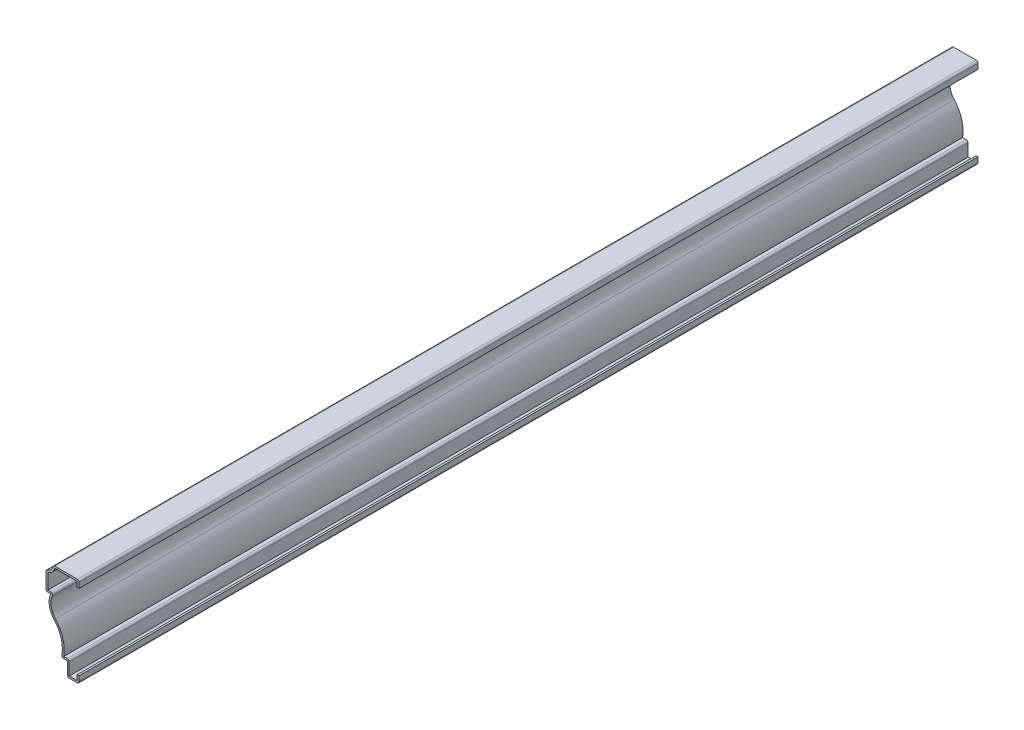
ISO-10303-21;
HEADER;
FILE_DESCRIPTION(('STEP AP214'),'2;1');
FILE_NAME('part.step','',(''),(''),'','','');
FILE_SCHEMA(('AUTOMOTIVE_DESIGN { 1 0 10303 214 1 1 1 1 }'));
ENDSEC;
DATA;
#1=APPLICATION_CONTEXT('core data for automotive mechanical design processes');
#2=APPLICATION_PROTOCOL_DEFINITION('international standard','automotive_design',2000,#1);
#3=PRODUCT_CONTEXT('',#1,'mechanical');
#4=PRODUCT('Part','Part','',(#3));
#5=PRODUCT_RELATED_PRODUCT_CATEGORY('part','',(#4));
#6=PRODUCT_DEFINITION_FORMATION('','',#4);
#7=PRODUCT_DEFINITION_CONTEXT('part definition',#1,'design');
#8=PRODUCT_DEFINITION('design','',#6,#7);
#9=PRODUCT_DEFINITION_SHAPE('','',#8);
#10=(LENGTH_UNIT() NAMED_UNIT(*) SI_UNIT(.MILLI.,.METRE.));
#11=(NAMED_UNIT(*) PLANE_ANGLE_UNIT() SI_UNIT($,.RADIAN.));
#12=(NAMED_UNIT(*) SI_UNIT($,.STERADIAN.) SOLID_ANGLE_UNIT());
#13=UNCERTAINTY_MEASURE_WITH_UNIT(LENGTH_MEASURE(1.E-05),#10,'distance_accuracy_value','');
#14=(GEOMETRIC_REPRESENTATION_CONTEXT(3) GLOBAL_UNCERTAINTY_ASSIGNED_CONTEXT((#13)) GLOBAL_UNIT_ASSIGNED_CONTEXT((#10,
#11,#12)) REPRESENTATION_CONTEXT('',''));
#15=CARTESIAN_POINT('',(0.,0.,0.));
#16=DIRECTION('',(0.,0.,1.));
#17=DIRECTION('',(1.,0.,0.));
#18=AXIS2_PLACEMENT_3D('',#15,#16,#17);
#19=CARTESIAN_POINT('',(0.,0.,-603.25));
#20=DIRECTION('',(1.,0.,0.));
#21=DIRECTION('',(0.,0.,-1.));
#22=AXIS2_PLACEMENT_3D('',#19,#20,#21);
#23=PLANE('',#22);
#24=DIRECTION('',(0.,1.,0.));
#25=VECTOR('',#24,1.);
#26=CARTESIAN_POINT('',(0.,0.,0.));
#27=LINE('',#26,#25);
#28=CARTESIAN_POINT('',(0.,1.27,0.));
#29=VERTEX_POINT('',#28);
#30=CARTESIAN_POINT('',(0.,4.7625,0.));
#31=VERTEX_POINT('',#30);
#32=EDGE_CURVE('E447',#29,#31,#27,.T.);
#33=ORIENTED_EDGE('',*,*,#32,.F.);
#34=DIRECTION('',(0.,0.,1.));
#35=VECTOR('',#34,1.);
#36=CARTESIAN_POINT('',(0.,1.27,-603.25));
#37=LINE('',#36,#35);
#38=CARTESIAN_POINT('',(0.,1.27,-603.25));
#39=VERTEX_POINT('',#38);
#40=EDGE_CURVE('E259',#29,#39,#37,.F.);
#41=ORIENTED_EDGE('',*,*,#40,.T.);
#42=DIRECTION('',(0.,1.,0.));
#43=VECTOR('',#42,1.);
#44=CARTESIAN_POINT('',(0.,0.,-603.25));
#45=LINE('',#44,#43);
#46=CARTESIAN_POINT('',(0.,4.7625,-603.25));
#47=VERTEX_POINT('',#46);
#48=EDGE_CURVE('E252',#39,#47,#45,.T.);
#49=ORIENTED_EDGE('',*,*,#48,.T.);
#50=DIRECTION('',(0.,0.,1.));
#51=VECTOR('',#50,1.);
#52=CARTESIAN_POINT('',(0.,4.7625,-603.25));
#53=LINE('',#52,#51);
#54=EDGE_CURVE('E256',#47,#31,#53,.T.);
#55=ORIENTED_EDGE('',*,*,#54,.T.);
#56=EDGE_LOOP('',(#33,#41,#49,#55));
#57=FACE_BOUND('',#56,.T.);
#58=ADVANCED_FACE('F35',(#57),#23,.T.);
#59=CARTESIAN_POINT('',(-7.9375,0.,-603.25));
#60=DIRECTION('',(0.,-1.,0.));
#61=DIRECTION('',(0.,0.,-1.));
#62=AXIS2_PLACEMENT_3D('',#59,#60,#61);
#63=PLANE('',#62);
#64=DIRECTION('',(1.,0.,0.));
#65=VECTOR('',#64,1.);
#66=CARTESIAN_POINT('',(-7.9375,0.,-603.25));
#67=LINE('',#66,#65);
#68=CARTESIAN_POINT('',(-6.6675,0.,-603.25));
#69=VERTEX_POINT('',#68);
#70=CARTESIAN_POINT('',(-1.27,0.,-603.25));
#71=VERTEX_POINT('',#70);
#72=EDGE_CURVE('E276',#69,#71,#67,.T.);
#73=ORIENTED_EDGE('',*,*,#72,.T.);
#74=DIRECTION('',(0.,0.,1.));
#75=VECTOR('',#74,1.);
#76=CARTESIAN_POINT('',(-1.27,0.,-603.25));
#77=LINE('',#76,#75);
#78=CARTESIAN_POINT('',(-1.27,0.,0.));
#79=VERTEX_POINT('',#78);
#80=EDGE_CURVE('E287',#71,#79,#77,.T.);
#81=ORIENTED_EDGE('',*,*,#80,.T.);
#82=DIRECTION('',(1.,0.,0.));
#83=VECTOR('',#82,1.);
#84=CARTESIAN_POINT('',(-7.9375,0.,0.));
#85=LINE('',#84,#83);
#86=CARTESIAN_POINT('',(-6.6675,0.,0.));
#87=VERTEX_POINT('',#86);
#88=EDGE_CURVE('E262',#87,#79,#85,.T.);
#89=ORIENTED_EDGE('',*,*,#88,.F.);
#90=DIRECTION('',(0.,0.,1.));
#91=VECTOR('',#90,1.);
#92=CARTESIAN_POINT('',(-6.6675,0.,-603.25));
#93=LINE('',#92,#91);
#94=EDGE_CURVE('E285',#87,#69,#93,.F.);
#95=ORIENTED_EDGE('',*,*,#94,.T.);
#96=EDGE_LOOP('',(#73,#81,#89,#95));
#97=FACE_BOUND('',#96,.T.);
#98=ADVANCED_FACE('F531',(#97),#63,.T.);
#99=CARTESIAN_POINT('',(-7.9375,9.525,-603.25));
#100=DIRECTION('',(-1.,0.,0.));
#101=DIRECTION('',(0.,-1.,0.));
#102=AXIS2_PLACEMENT_3D('',#99,#100,#101);
#103=PLANE('',#102);
#104=DIRECTION('',(0.,-1.,0.));
#105=VECTOR('',#104,1.);
#106=CARTESIAN_POINT('',(-7.9375,9.525,-603.25));
#107=LINE('',#106,#105);
#108=CARTESIAN_POINT('',(-7.9375,9.525,-603.25));
#109=VERTEX_POINT('',#108);
#110=CARTESIAN_POINT('',(-7.9375,1.27,-603.25));
#111=VERTEX_POINT('',#110);
#112=EDGE_CURVE('E281',#109,#111,#107,.T.);
#113=ORIENTED_EDGE('',*,*,#112,.T.);
#114=DIRECTION('',(0.,0.,1.));
#115=VECTOR('',#114,1.);
#116=CARTESIAN_POINT('',(-7.9375,1.27,-603.25));
#117=LINE('',#116,#115);
#118=CARTESIAN_POINT('',(-7.9375,1.27,0.));
#119=VERTEX_POINT('',#118);
#120=EDGE_CURVE('E327',#111,#119,#117,.T.);
#121=ORIENTED_EDGE('',*,*,#120,.T.);
#122=DIRECTION('',(0.,-1.,0.));
#123=VECTOR('',#122,1.);
#124=CARTESIAN_POINT('',(-7.9375,9.525,0.));
#125=LINE('',#124,#123);
#126=CARTESIAN_POINT('',(-7.9375,9.525,0.));
#127=VERTEX_POINT('',#126);
#128=EDGE_CURVE('E397',#127,#119,#125,.T.);
#129=ORIENTED_EDGE('',*,*,#128,.F.);
#130=DIRECTION('',(0.,0.,1.));
#131=VECTOR('',#130,1.);
#132=CARTESIAN_POINT('',(-7.9375,9.525,-603.25));
#133=LINE('',#132,#131);
#134=EDGE_CURVE('E288',#109,#127,#133,.T.);
#135=ORIENTED_EDGE('',*,*,#134,.F.);
#136=EDGE_LOOP('',(#113,#121,#129,#135));
#137=FACE_BOUND('',#136,.T.);
#138=ADVANCED_FACE('F541',(#137),#103,.T.);
#139=CARTESIAN_POINT('',(-11.90625,9.525,-603.25));
#140=DIRECTION('',(0.,-1.,0.));
#141=DIRECTION('',(0.,0.,-1.));
#142=AXIS2_PLACEMENT_3D('',#139,#140,#141);
#143=PLANE('',#142);
#144=DIRECTION('',(1.,0.,0.));
#145=VECTOR('',#144,1.);
#146=CARTESIAN_POINT('',(-11.90625,9.525,0.));
#147=LINE('',#146,#145);
#148=CARTESIAN_POINT('',(-10.3416076078881,9.525,0.));
#149=VERTEX_POINT('',#148);
#150=EDGE_CURVE('E395',#149,#127,#147,.T.);
#151=ORIENTED_EDGE('',*,*,#150,.F.);
#152=DIRECTION('',(0.,0.,1.));
#153=VECTOR('',#152,1.);
#154=CARTESIAN_POINT('',(-10.3416076078881,9.525,-603.25));
#155=LINE('',#154,#153);
#156=CARTESIAN_POINT('',(-10.3416076078881,9.525,-603.25));
#157=VERTEX_POINT('',#156);
#158=EDGE_CURVE('E337',#149,#157,#155,.F.);
#159=ORIENTED_EDGE('',*,*,#158,.T.);
#160=DIRECTION('',(1.,0.,0.));
#161=VECTOR('',#160,1.);
#162=CARTESIAN_POINT('',(-11.90625,9.525,-603.25));
#163=LINE('',#162,#161);
#164=EDGE_CURVE('E522',#157,#109,#163,.T.);
#165=ORIENTED_EDGE('',*,*,#164,.T.);
#166=ORIENTED_EDGE('',*,*,#134,.T.);
#167=EDGE_LOOP('',(#151,#159,#165,#166));
#168=FACE_BOUND('',#167,.T.);
#169=ADVANCED_FACE('F545',(#168),#143,.T.);
#170=CARTESIAN_POINT('',(-32.7071953191886,14.684375,-603.25));
#171=DIRECTION('',(0.,0.,1.));
#172=DIRECTION('',(1.,0.,0.));
#173=AXIS2_PLACEMENT_3D('',#170,#171,#172);
#174=CYLINDRICAL_SURFACE('',#173,21.43125);
#175=CARTESIAN_POINT('',(-32.7071953191886,14.684375,-603.25));
#176=DIRECTION('',(0.,0.,-1.));
#177=DIRECTION('',(-1.,0.,0.));
#178=AXIS2_PLACEMENT_3D('',#175,#176,#177);
#179=CIRCLE('',#178,21.43125);
#180=CARTESIAN_POINT('',(-16.8450266431102,29.095831604179,-603.25));
#181=VERTEX_POINT('',#180);
#182=CARTESIAN_POINT('',(-11.5928292980308,11.0125874125874,-603.25));
#183=VERTEX_POINT('',#182);
#184=EDGE_CURVE('E519',#181,#183,#179,.T.);
#185=ORIENTED_EDGE('',*,*,#184,.T.);
#186=DIRECTION('',(0.,0.,1.));
#187=VECTOR('',#186,1.);
#188=CARTESIAN_POINT('',(-11.5928292980308,11.0125874125874,-603.25));
#189=LINE('',#188,#187);
#190=CARTESIAN_POINT('',(-11.5928292980308,11.0125874125874,0.));
#191=VERTEX_POINT('',#190);
#192=EDGE_CURVE('E334',#183,#191,#189,.T.);
#193=ORIENTED_EDGE('',*,*,#192,.T.);
#194=CARTESIAN_POINT('',(-32.7071953191886,14.684375,0.));
#195=DIRECTION('',(0.,0.,-1.));
#196=DIRECTION('',(-1.,0.,0.));
#197=AXIS2_PLACEMENT_3D('',#194,#195,#196);
#198=CIRCLE('',#197,21.43125);
#199=CARTESIAN_POINT('',(-16.8450266431102,29.095831604179,0.));
#200=VERTEX_POINT('',#199);
#201=EDGE_CURVE('E392',#200,#191,#198,.T.);
#202=ORIENTED_EDGE('',*,*,#201,.F.);
#203=DIRECTION('',(0.,0.,1.));
#204=VECTOR('',#203,1.);
#205=CARTESIAN_POINT('',(-16.8450266431102,29.095831604179,-603.25));
#206=LINE('',#205,#204);
#207=EDGE_CURVE('E403',#181,#200,#206,.T.);
#208=ORIENTED_EDGE('',*,*,#207,.F.);
#209=EDGE_LOOP('',(#185,#193,#202,#208));
#210=FACE_BOUND('',#209,.T.);
#211=ADVANCED_FACE('F554',(#210),#174,.F.);
#212=CARTESIAN_POINT('',(-7.44522298321182,37.6359540362851,-603.25));
#213=DIRECTION('',(0.,0.,1.));
#214=DIRECTION('',(1.,0.,0.));
#215=AXIS2_PLACEMENT_3D('',#212,#213,#214);
#216=CYLINDRICAL_SURFACE('',#215,12.7);
#217=CARTESIAN_POINT('',(-7.44522298321182,37.6359540362851,0.));
#218=DIRECTION('',(0.,0.,1.));
#219=DIRECTION('',(1.,0.,0.));
#220=AXIS2_PLACEMENT_3D('',#217,#218,#219);
#221=CIRCLE('',#220,12.7);
#222=CARTESIAN_POINT('',(-19.05,42.7953290362851,0.));
#223=VERTEX_POINT('',#222);
#224=EDGE_CURVE('E389',#223,#200,#221,.T.);
#225=ORIENTED_EDGE('',*,*,#224,.F.);
#226=DIRECTION('',(0.,0.,1.));
#227=VECTOR('',#226,1.);
#228=CARTESIAN_POINT('',(-19.05,42.7953290362851,-603.25));
#229=LINE('',#228,#227);
#230=CARTESIAN_POINT('',(-19.05,42.7953290362851,-603.25));
#231=VERTEX_POINT('',#230);
#232=EDGE_CURVE('E405',#231,#223,#229,.T.);
#233=ORIENTED_EDGE('',*,*,#232,.F.);
#234=CARTESIAN_POINT('',(-7.44522298321182,37.6359540362851,-603.25));
#235=DIRECTION('',(0.,0.,1.));
#236=DIRECTION('',(1.,0.,0.));
#237=AXIS2_PLACEMENT_3D('',#234,#235,#236);
#238=CIRCLE('',#237,12.7);
#239=EDGE_CURVE('E516',#231,#181,#238,.T.);
#240=ORIENTED_EDGE('',*,*,#239,.T.);
#241=ORIENTED_EDGE('',*,*,#207,.T.);
#242=EDGE_LOOP('',(#225,#233,#240,#241));
#243=FACE_BOUND('',#242,.T.);
#244=ADVANCED_FACE('F559',(#243),#216,.T.);
#245=CARTESIAN_POINT('',(-22.225,42.7953290362851,-603.25));
#246=DIRECTION('',(0.,-1.,0.));
#247=DIRECTION('',(1.,0.,0.));
#248=AXIS2_PLACEMENT_3D('',#245,#246,#247);
#249=PLANE('',#248);
#250=DIRECTION('',(1.,0.,0.));
#251=VECTOR('',#250,1.);
#252=CARTESIAN_POINT('',(-22.225,42.7953290362851,0.));
#253=LINE('',#252,#251);
#254=CARTESIAN_POINT('',(-20.955,42.7953290362851,0.));
#255=VERTEX_POINT('',#254);
#256=EDGE_CURVE('E387',#255,#223,#253,.T.);
#257=ORIENTED_EDGE('',*,*,#256,.F.);
#258=DIRECTION('',(0.,0.,1.));
#259=VECTOR('',#258,1.);
#260=CARTESIAN_POINT('',(-20.955,42.7953290362851,-603.25));
#261=LINE('',#260,#259);
#262=CARTESIAN_POINT('',(-20.955,42.7953290362851,-603.25));
#263=VERTEX_POINT('',#262);
#264=EDGE_CURVE('E349',#255,#263,#261,.F.);
#265=ORIENTED_EDGE('',*,*,#264,.T.);
#266=DIRECTION('',(1.,0.,0.));
#267=VECTOR('',#266,1.);
#268=CARTESIAN_POINT('',(-22.225,42.7953290362851,-603.25));
#269=LINE('',#268,#267);
#270=EDGE_CURVE('E514',#263,#231,#269,.T.);
#271=ORIENTED_EDGE('',*,*,#270,.T.);
#272=ORIENTED_EDGE('',*,*,#232,.T.);
#273=EDGE_LOOP('',(#257,#265,#271,#272));
#274=FACE_BOUND('',#273,.T.);
#275=ADVANCED_FACE('F807',(#274),#249,.T.);
#276=CARTESIAN_POINT('',(-22.225,55.5625,-603.25));
#277=DIRECTION('',(-1.,0.,0.));
#278=DIRECTION('',(0.,-1.,0.));
#279=AXIS2_PLACEMENT_3D('',#276,#277,#278);
#280=PLANE('',#279);
#281=DIRECTION('',(0.,-1.,0.));
#282=VECTOR('',#281,1.);
#283=CARTESIAN_POINT('',(-22.225,55.5625,-603.25));
#284=LINE('',#283,#282);
#285=CARTESIAN_POINT('',(-22.225,54.4276992403304,-603.25));
#286=VERTEX_POINT('',#285);
#287=CARTESIAN_POINT('',(-22.225,44.0653290362851,-603.25));
#288=VERTEX_POINT('',#287);
#289=EDGE_CURVE('E511',#286,#288,#284,.T.);
#290=ORIENTED_EDGE('',*,*,#289,.T.);
#291=DIRECTION('',(0.,0.,1.));
#292=VECTOR('',#291,1.);
#293=CARTESIAN_POINT('',(-22.225,44.0653290362851,-603.25));
#294=LINE('',#293,#292);
#295=CARTESIAN_POINT('',(-22.225,44.0653290362851,0.));
#296=VERTEX_POINT('',#295);
#297=EDGE_CURVE('E346',#288,#296,#294,.T.);
#298=ORIENTED_EDGE('',*,*,#297,.T.);
#299=DIRECTION('',(0.,-1.,0.));
#300=VECTOR('',#299,1.);
#301=CARTESIAN_POINT('',(-22.225,55.5625,0.));
#302=LINE('',#301,#300);
#303=CARTESIAN_POINT('',(-22.225,54.4276992403304,0.));
#304=VERTEX_POINT('',#303);
#305=EDGE_CURVE('E379',#304,#296,#302,.T.);
#306=ORIENTED_EDGE('',*,*,#305,.F.);
#307=DIRECTION('',(0.,0.,1.));
#308=VECTOR('',#307,1.);
#309=CARTESIAN_POINT('',(-22.225,54.4276992403304,-603.25));
#310=LINE('',#309,#308);
#311=EDGE_CURVE('E344',#304,#286,#310,.F.);
#312=ORIENTED_EDGE('',*,*,#311,.T.);
#313=EDGE_LOOP('',(#290,#298,#306,#312));
#314=FACE_BOUND('',#313,.T.);
#315=ADVANCED_FACE('F571',(#314),#280,.T.);
#316=CARTESIAN_POINT('',(-22.225,60.325,-603.25));
#317=DIRECTION('',(0.,0.,1.));
#318=DIRECTION('',(1.,0.,0.));
#319=AXIS2_PLACEMENT_3D('',#316,#317,#318);
#320=CYLINDRICAL_SURFACE('',#319,4.7625);
#321=CARTESIAN_POINT('',(-22.225,60.325,-603.25));
#322=DIRECTION('',(0.,0.,-1.));
#323=DIRECTION('',(-1.,0.,0.));
#324=AXIS2_PLACEMENT_3D('',#321,#322,#323);
#325=CIRCLE('',#324,4.7625);
#326=CARTESIAN_POINT('',(-17.5692362423661,59.3223684210526,-603.25));
#327=VERTEX_POINT('',#326);
#328=CARTESIAN_POINT('',(-21.2223684210526,55.6692362423661,-603.25));
#329=VERTEX_POINT('',#328);
#330=EDGE_CURVE('E508',#327,#329,#325,.T.);
#331=ORIENTED_EDGE('',*,*,#330,.T.);
#332=DIRECTION('',(0.,0.,1.));
#333=VECTOR('',#332,1.);
#334=CARTESIAN_POINT('',(-21.2223684210526,55.6692362423661,-603.25));
#335=LINE('',#334,#333);
#336=CARTESIAN_POINT('',(-21.2223684210526,55.6692362423661,0.));
#337=VERTEX_POINT('',#336);
#338=EDGE_CURVE('E353',#329,#337,#335,.T.);
#339=ORIENTED_EDGE('',*,*,#338,.T.);
#340=CARTESIAN_POINT('',(-22.225,60.325,0.));
#341=DIRECTION('',(0.,0.,-1.));
#342=DIRECTION('',(-1.,0.,0.));
#343=AXIS2_PLACEMENT_3D('',#340,#341,#342);
#344=CIRCLE('',#343,4.7625);
#345=CARTESIAN_POINT('',(-17.5692362423661,59.3223684210526,0.));
#346=VERTEX_POINT('',#345);
#347=EDGE_CURVE('E376',#346,#337,#344,.T.);
#348=ORIENTED_EDGE('',*,*,#347,.F.);
#349=DIRECTION('',(0.,0.,1.));
#350=VECTOR('',#349,1.);
#351=CARTESIAN_POINT('',(-17.5692362423661,59.3223684210526,-603.25));
#352=LINE('',#351,#350);
#353=EDGE_CURVE('E351',#346,#327,#352,.F.);
#354=ORIENTED_EDGE('',*,*,#353,.T.);
#355=EDGE_LOOP('',(#331,#339,#348,#354));
#356=FACE_BOUND('',#355,.T.);
#357=ADVANCED_FACE('F578',(#356),#320,.F.);
#358=CARTESIAN_POINT('',(0.,60.325,-603.25));
#359=DIRECTION('',(0.,1.,0.));
#360=DIRECTION('',(0.,0.,1.));
#361=AXIS2_PLACEMENT_3D('',#358,#359,#360);
#362=PLANE('',#361);
#363=DIRECTION('',(-1.,0.,0.));
#364=VECTOR('',#363,1.);
#365=CARTESIAN_POINT('',(0.,60.325,-603.25));
#366=LINE('',#365,#364);
#367=CARTESIAN_POINT('',(-1.27,60.325,-603.25));
#368=VERTEX_POINT('',#367);
#369=CARTESIAN_POINT('',(-16.3276992403304,60.325,-603.25));
#370=VERTEX_POINT('',#369);
#371=EDGE_CURVE('E367',#368,#370,#366,.T.);
#372=ORIENTED_EDGE('',*,*,#371,.T.);
#373=DIRECTION('',(0.,0.,1.));
#374=VECTOR('',#373,1.);
#375=CARTESIAN_POINT('',(-16.3276992403304,60.325,-603.25));
#376=LINE('',#375,#374);
#377=CARTESIAN_POINT('',(-16.3276992403304,60.325,0.));
#378=VERTEX_POINT('',#377);
#379=EDGE_CURVE('E43',#370,#378,#376,.T.);
#380=ORIENTED_EDGE('',*,*,#379,.T.);
#381=DIRECTION('',(-1.,0.,0.));
#382=VECTOR('',#381,1.);
#383=CARTESIAN_POINT('',(0.,60.325,0.));
#384=LINE('',#383,#382);
#385=CARTESIAN_POINT('',(-1.27,60.325,0.));
#386=VERTEX_POINT('',#385);
#387=EDGE_CURVE('E364',#386,#378,#384,.T.);
#388=ORIENTED_EDGE('',*,*,#387,.F.);
#389=DIRECTION('',(0.,0.,1.));
#390=VECTOR('',#389,1.);
#391=CARTESIAN_POINT('',(-1.27,60.325,-603.25));
#392=LINE('',#391,#390);
#393=EDGE_CURVE('E356',#386,#368,#392,.F.);
#394=ORIENTED_EDGE('',*,*,#393,.T.);
#395=EDGE_LOOP('',(#372,#380,#388,#394));
#396=FACE_BOUND('',#395,.T.);
#397=ADVANCED_FACE('F363',(#396),#362,.T.);
#398=CARTESIAN_POINT('',(0.,55.5625,-603.25));
#399=DIRECTION('',(1.,0.,0.));
#400=DIRECTION('',(0.,0.,-1.));
#401=AXIS2_PLACEMENT_3D('',#398,#399,#400);
#402=PLANE('',#401);
#403=DIRECTION('',(0.,1.,0.));
#404=VECTOR('',#403,1.);
#405=CARTESIAN_POINT('',(0.,55.5625,-603.25));
#406=LINE('',#405,#404);
#407=CARTESIAN_POINT('',(0.,55.5625,-603.25));
#408=VERTEX_POINT('',#407);
#409=CARTESIAN_POINT('',(0.,59.055,-603.25));
#410=VERTEX_POINT('',#409);
#411=EDGE_CURVE('E504',#408,#410,#406,.T.);
#412=ORIENTED_EDGE('',*,*,#411,.T.);
#413=DIRECTION('',(0.,0.,1.));
#414=VECTOR('',#413,1.);
#415=CARTESIAN_POINT('',(0.,59.055,-603.25));
#416=LINE('',#415,#414);
#417=CARTESIAN_POINT('',(0.,59.055,0.));
#418=VERTEX_POINT('',#417);
#419=EDGE_CURVE('E11',#410,#418,#416,.T.);
#420=ORIENTED_EDGE('',*,*,#419,.T.);
#421=DIRECTION('',(0.,1.,0.));
#422=VECTOR('',#421,1.);
#423=CARTESIAN_POINT('',(0.,55.5625,0.));
#424=LINE('',#423,#422);
#425=CARTESIAN_POINT('',(0.,55.5625,0.));
#426=VERTEX_POINT('',#425);
#427=EDGE_CURVE('E377',#426,#418,#424,.T.);
#428=ORIENTED_EDGE('',*,*,#427,.F.);
#429=DIRECTION('',(0.,0.,1.));
#430=VECTOR('',#429,1.);
#431=CARTESIAN_POINT('',(0.,55.5625,-603.25));
#432=LINE('',#431,#430);
#433=EDGE_CURVE('E408',#408,#426,#432,.T.);
#434=ORIENTED_EDGE('',*,*,#433,.F.);
#435=EDGE_LOOP('',(#412,#420,#428,#434));
#436=FACE_BOUND('',#435,.T.);
#437=ADVANCED_FACE('F777',(#436),#402,.T.);
#438=CARTESIAN_POINT('',(0.,55.5625,-603.25));
#439=DIRECTION('',(0.,1.,0.));
#440=DIRECTION('',(0.,0.,1.));
#441=AXIS2_PLACEMENT_3D('',#438,#439,#440);
#442=PLANE('',#441);
#443=DIRECTION('',(-1.,0.,0.));
#444=VECTOR('',#443,1.);
#445=CARTESIAN_POINT('',(0.,55.5625,0.));
#446=LINE('',#445,#444);
#447=CARTESIAN_POINT('',(-1.27,55.5625,0.));
#448=VERTEX_POINT('',#447);
#449=EDGE_CURVE('E381',#426,#448,#446,.T.);
#450=ORIENTED_EDGE('',*,*,#449,.T.);
#451=DIRECTION('',(0.,0.,1.));
#452=VECTOR('',#451,1.);
#453=CARTESIAN_POINT('',(-1.27,55.5625,-603.25));
#454=LINE('',#453,#452);
#455=CARTESIAN_POINT('',(-1.27,55.5625,-603.25));
#456=VERTEX_POINT('',#455);
#457=EDGE_CURVE('E410',#456,#448,#454,.T.);
#458=ORIENTED_EDGE('',*,*,#457,.F.);
#459=DIRECTION('',(-1.,0.,0.));
#460=VECTOR('',#459,1.);
#461=CARTESIAN_POINT('',(0.,55.5625,-603.25));
#462=LINE('',#461,#460);
#463=EDGE_CURVE('E502',#408,#456,#462,.T.);
#464=ORIENTED_EDGE('',*,*,#463,.F.);
#465=ORIENTED_EDGE('',*,*,#433,.T.);
#466=EDGE_LOOP('',(#450,#458,#464,#465));
#467=FACE_BOUND('',#466,.T.);
#468=ADVANCED_FACE('F471',(#467),#442,.F.);
#469=CARTESIAN_POINT('',(-1.27,55.5625,-603.25));
#470=DIRECTION('',(1.,0.,0.));
#471=DIRECTION('',(0.,0.,-1.));
#472=AXIS2_PLACEMENT_3D('',#469,#470,#471);
#473=PLANE('',#472);
#474=DIRECTION('',(0.,1.,0.));
#475=VECTOR('',#474,1.);
#476=CARTESIAN_POINT('',(-1.27,55.5625,0.));
#477=LINE('',#476,#475);
#478=CARTESIAN_POINT('',(-1.27,59.055,0.));
#479=VERTEX_POINT('',#478);
#480=EDGE_CURVE('E467',#448,#479,#477,.T.);
#481=ORIENTED_EDGE('',*,*,#480,.T.);
#482=DIRECTION('',(0.,0.,1.));
#483=VECTOR('',#482,1.);
#484=CARTESIAN_POINT('',(-1.27,59.055,-603.25));
#485=LINE('',#484,#483);
#486=CARTESIAN_POINT('',(-1.27,59.055,-603.25));
#487=VERTEX_POINT('',#486);
#488=EDGE_CURVE('E413',#487,#479,#485,.T.);
#489=ORIENTED_EDGE('',*,*,#488,.F.);
#490=DIRECTION('',(0.,1.,0.));
#491=VECTOR('',#490,1.);
#492=CARTESIAN_POINT('',(-1.27,55.5625,-603.25));
#493=LINE('',#492,#491);
#494=EDGE_CURVE('E479',#456,#487,#493,.T.);
#495=ORIENTED_EDGE('',*,*,#494,.F.);
#496=ORIENTED_EDGE('',*,*,#457,.T.);
#497=EDGE_LOOP('',(#481,#489,#495,#496));
#498=FACE_BOUND('',#497,.T.);
#499=ADVANCED_FACE('F477',(#498),#473,.F.);
#500=CARTESIAN_POINT('',(0.,59.055,-603.25));
#501=DIRECTION('',(0.,1.,0.));
#502=DIRECTION('',(0.,0.,1.));
#503=AXIS2_PLACEMENT_3D('',#500,#501,#502);
#504=PLANE('',#503);
#505=DIRECTION('',(1.,0.,0.));
#506=VECTOR('',#505,1.);
#507=CARTESIAN_POINT('',(0.,59.055,0.));
#508=LINE('',#507,#506);
#509=CARTESIAN_POINT('',(-16.3276992403304,59.055,0.));
#510=VERTEX_POINT('',#509);
#511=EDGE_CURVE('E465',#479,#510,#508,.F.);
#512=ORIENTED_EDGE('',*,*,#511,.T.);
#513=DIRECTION('',(0.,0.,1.));
#514=VECTOR('',#513,1.);
#515=CARTESIAN_POINT('',(-16.3276992403304,59.055,-603.25));
#516=LINE('',#515,#514);
#517=CARTESIAN_POINT('',(-16.3276992403304,59.055,-603.25));
#518=VERTEX_POINT('',#517);
#519=EDGE_CURVE('E416',#518,#510,#516,.T.);
#520=ORIENTED_EDGE('',*,*,#519,.F.);
#521=DIRECTION('',(1.,0.,0.));
#522=VECTOR('',#521,1.);
#523=CARTESIAN_POINT('',(0.,59.055,-603.25));
#524=LINE('',#523,#522);
#525=EDGE_CURVE('E493',#487,#518,#524,.F.);
#526=ORIENTED_EDGE('',*,*,#525,.F.);
#527=ORIENTED_EDGE('',*,*,#488,.T.);
#528=EDGE_LOOP('',(#512,#520,#526,#527));
#529=FACE_BOUND('',#528,.T.);
#530=ADVANCED_FACE('F485',(#529),#504,.F.);
#531=CARTESIAN_POINT('',(-22.225,60.325,-603.25));
#532=DIRECTION('',(0.,0.,1.));
#533=DIRECTION('',(1.,0.,0.));
#534=AXIS2_PLACEMENT_3D('',#531,#532,#533);
#535=CYLINDRICAL_SURFACE('',#534,6.0325);
#536=CARTESIAN_POINT('',(-22.225,60.325,0.));
#537=DIRECTION('',(0.,0.,1.));
#538=DIRECTION('',(1.,0.,0.));
#539=AXIS2_PLACEMENT_3D('',#536,#537,#538);
#540=CIRCLE('',#539,6.0325);
#541=CARTESIAN_POINT('',(-20.955,54.4276992403304,0.));
#542=VERTEX_POINT('',#541);
#543=EDGE_CURVE('E463',#510,#542,#540,.F.);
#544=ORIENTED_EDGE('',*,*,#543,.T.);
#545=DIRECTION('',(0.,0.,1.));
#546=VECTOR('',#545,1.);
#547=CARTESIAN_POINT('',(-20.955,54.4276992403304,-603.25));
#548=LINE('',#547,#546);
#549=CARTESIAN_POINT('',(-20.955,54.4276992403304,-603.25));
#550=VERTEX_POINT('',#549);
#551=EDGE_CURVE('E419',#550,#542,#548,.T.);
#552=ORIENTED_EDGE('',*,*,#551,.F.);
#553=CARTESIAN_POINT('',(-22.225,60.325,-603.25));
#554=DIRECTION('',(0.,0.,1.));
#555=DIRECTION('',(1.,0.,0.));
#556=AXIS2_PLACEMENT_3D('',#553,#554,#555);
#557=CIRCLE('',#556,6.0325);
#558=EDGE_CURVE('E491',#518,#550,#557,.F.);
#559=ORIENTED_EDGE('',*,*,#558,.F.);
#560=ORIENTED_EDGE('',*,*,#519,.T.);
#561=EDGE_LOOP('',(#544,#552,#559,#560));
#562=FACE_BOUND('',#561,.T.);
#563=ADVANCED_FACE('F489',(#562),#535,.T.);
#564=CARTESIAN_POINT('',(-20.955,55.5625,-603.25));
#565=DIRECTION('',(-1.,0.,0.));
#566=DIRECTION('',(0.,-1.,0.));
#567=AXIS2_PLACEMENT_3D('',#564,#565,#566);
#568=PLANE('',#567);
#569=DIRECTION('',(0.,-1.,0.));
#570=VECTOR('',#569,1.);
#571=CARTESIAN_POINT('',(-20.955,55.5625,0.));
#572=LINE('',#571,#570);
#573=CARTESIAN_POINT('',(-20.955,44.0653290362851,0.));
#574=VERTEX_POINT('',#573);
#575=EDGE_CURVE('E461',#542,#574,#572,.T.);
#576=ORIENTED_EDGE('',*,*,#575,.T.);
#577=DIRECTION('',(0.,0.,1.));
#578=VECTOR('',#577,1.);
#579=CARTESIAN_POINT('',(-20.955,44.0653290362851,-603.25));
#580=LINE('',#579,#578);
#581=CARTESIAN_POINT('',(-20.955,44.0653290362851,-603.25));
#582=VERTEX_POINT('',#581);
#583=EDGE_CURVE('E422',#582,#574,#580,.T.);
#584=ORIENTED_EDGE('',*,*,#583,.F.);
#585=DIRECTION('',(0.,-1.,0.));
#586=VECTOR('',#585,1.);
#587=CARTESIAN_POINT('',(-20.955,55.5625,-603.25));
#588=LINE('',#587,#586);
#589=EDGE_CURVE('E494',#550,#582,#588,.T.);
#590=ORIENTED_EDGE('',*,*,#589,.F.);
#591=ORIENTED_EDGE('',*,*,#551,.T.);
#592=EDGE_LOOP('',(#576,#584,#590,#591));
#593=FACE_BOUND('',#592,.T.);
#594=ADVANCED_FACE('F739',(#593),#568,.F.);
#595=CARTESIAN_POINT('',(-22.225,44.0653290362851,-603.25));
#596=DIRECTION('',(0.,-1.,0.));
#597=DIRECTION('',(1.,0.,0.));
#598=AXIS2_PLACEMENT_3D('',#595,#596,#597);
#599=PLANE('',#598);
#600=DIRECTION('',(1.,0.,0.));
#601=VECTOR('',#600,1.);
#602=CARTESIAN_POINT('',(-22.225,44.0653290362851,0.));
#603=LINE('',#602,#601);
#604=CARTESIAN_POINT('',(-19.05,44.0653290362851,0.));
#605=VERTEX_POINT('',#604);
#606=EDGE_CURVE('E458',#574,#605,#603,.T.);
#607=ORIENTED_EDGE('',*,*,#606,.T.);
#608=DIRECTION('',(0.,0.,1.));
#609=VECTOR('',#608,1.);
#610=CARTESIAN_POINT('',(-19.05,44.0653290362851,-603.25));
#611=LINE('',#610,#609);
#612=CARTESIAN_POINT('',(-19.05,44.0653290362851,-603.25));
#613=VERTEX_POINT('',#612);
#614=EDGE_CURVE('E342',#605,#613,#611,.F.);
#615=ORIENTED_EDGE('',*,*,#614,.T.);
#616=DIRECTION('',(1.,0.,0.));
#617=VECTOR('',#616,1.);
#618=CARTESIAN_POINT('',(-22.225,44.0653290362851,-603.25));
#619=LINE('',#618,#617);
#620=EDGE_CURVE('E497',#582,#613,#619,.T.);
#621=ORIENTED_EDGE('',*,*,#620,.F.);
#622=ORIENTED_EDGE('',*,*,#583,.T.);
#623=EDGE_LOOP('',(#607,#615,#621,#622));
#624=FACE_BOUND('',#623,.T.);
#625=ADVANCED_FACE('F730',(#624),#599,.F.);
#626=CARTESIAN_POINT('',(-7.44522298321182,37.6359540362851,-603.25));
#627=DIRECTION('',(0.,0.,1.));
#628=DIRECTION('',(1.,0.,0.));
#629=AXIS2_PLACEMENT_3D('',#626,#627,#628);
#630=CYLINDRICAL_SURFACE('',#629,11.43);
#631=CARTESIAN_POINT('',(-7.44522298321182,37.6359540362851,-603.25));
#632=DIRECTION('',(0.,0.,1.));
#633=DIRECTION('',(1.,0.,0.));
#634=AXIS2_PLACEMENT_3D('',#631,#632,#633);
#635=CIRCLE('',#634,11.43);
#636=CARTESIAN_POINT('',(-17.8895222983212,42.2793915362851,-603.25));
#637=VERTEX_POINT('',#636);
#638=CARTESIAN_POINT('',(-15.9050462771203,29.9498438473896,-603.25));
#639=VERTEX_POINT('',#638);
#640=EDGE_CURVE('E896',#637,#639,#635,.T.);
#641=ORIENTED_EDGE('',*,*,#640,.F.);
#642=DIRECTION('',(0.,0.,1.));
#643=VECTOR('',#642,1.);
#644=CARTESIAN_POINT('',(-17.8895222983212,42.2793915362851,-603.25));
#645=LINE('',#644,#643);
#646=CARTESIAN_POINT('',(-17.8895222983212,42.2793915362851,0.));
#647=VERTEX_POINT('',#646);
#648=EDGE_CURVE('E339',#637,#647,#645,.T.);
#649=ORIENTED_EDGE('',*,*,#648,.T.);
#650=CARTESIAN_POINT('',(-7.44522298321182,37.6359540362851,0.));
#651=DIRECTION('',(0.,0.,1.));
#652=DIRECTION('',(1.,0.,0.));
#653=AXIS2_PLACEMENT_3D('',#650,#651,#652);
#654=CIRCLE('',#653,11.43);
#655=CARTESIAN_POINT('',(-15.9050462771203,29.9498438473896,0.));
#656=VERTEX_POINT('',#655);
#657=EDGE_CURVE('E456',#647,#656,#654,.T.);
#658=ORIENTED_EDGE('',*,*,#657,.T.);
#659=DIRECTION('',(0.,0.,1.));
#660=VECTOR('',#659,1.);
#661=CARTESIAN_POINT('',(-15.9050462771203,29.9498438473896,-603.25));
#662=LINE('',#661,#660);
#663=EDGE_CURVE('E425',#639,#656,#662,.T.);
#664=ORIENTED_EDGE('',*,*,#663,.F.);
#665=EDGE_LOOP('',(#641,#649,#658,#664));
#666=FACE_BOUND('',#665,.T.);
#667=ADVANCED_FACE('F721',(#666),#630,.F.);
#668=CARTESIAN_POINT('',(-32.7071953191886,14.684375,-603.25));
#669=DIRECTION('',(0.,0.,1.));
#670=DIRECTION('',(1.,0.,0.));
#671=AXIS2_PLACEMENT_3D('',#668,#669,#670);
#672=CYLINDRICAL_SURFACE('',#671,22.70125);
#673=CARTESIAN_POINT('',(-32.7071953191886,14.684375,0.));
#674=DIRECTION('',(0.,0.,1.));
#675=DIRECTION('',(1.,0.,0.));
#676=AXIS2_PLACEMENT_3D('',#673,#674,#675);
#677=CIRCLE('',#676,22.70125);
#678=CARTESIAN_POINT('',(-10.3416076078881,10.795,0.));
#679=VERTEX_POINT('',#678);
#680=EDGE_CURVE('E454',#656,#679,#677,.F.);
#681=ORIENTED_EDGE('',*,*,#680,.T.);
#682=DIRECTION('',(0.,0.,1.));
#683=VECTOR('',#682,1.);
#684=CARTESIAN_POINT('',(-10.3416076078881,10.795,-603.25));
#685=LINE('',#684,#683);
#686=CARTESIAN_POINT('',(-10.3416076078881,10.795,-603.25));
#687=VERTEX_POINT('',#686);
#688=EDGE_CURVE('E428',#687,#679,#685,.T.);
#689=ORIENTED_EDGE('',*,*,#688,.F.);
#690=CARTESIAN_POINT('',(-32.7071953191886,14.684375,-603.25));
#691=DIRECTION('',(0.,0.,1.));
#692=DIRECTION('',(1.,0.,0.));
#693=AXIS2_PLACEMENT_3D('',#690,#691,#692);
#694=CIRCLE('',#693,22.70125);
#695=EDGE_CURVE('E898',#639,#687,#694,.F.);
#696=ORIENTED_EDGE('',*,*,#695,.F.);
#697=ORIENTED_EDGE('',*,*,#663,.T.);
#698=EDGE_LOOP('',(#681,#689,#696,#697));
#699=FACE_BOUND('',#698,.T.);
#700=ADVANCED_FACE('F713',(#699),#672,.T.);
#701=CARTESIAN_POINT('',(-11.90625,10.795,-603.25));
#702=DIRECTION('',(0.,-1.,0.));
#703=DIRECTION('',(0.,0.,-1.));
#704=AXIS2_PLACEMENT_3D('',#701,#702,#703);
#705=PLANE('',#704);
#706=DIRECTION('',(1.,0.,0.));
#707=VECTOR('',#706,1.);
#708=CARTESIAN_POINT('',(-11.90625,10.795,0.));
#709=LINE('',#708,#707);
#710=CARTESIAN_POINT('',(-7.9375,10.795,0.));
#711=VERTEX_POINT('',#710);
#712=EDGE_CURVE('E452',#679,#711,#709,.T.);
#713=ORIENTED_EDGE('',*,*,#712,.T.);
#714=DIRECTION('',(0.,0.,1.));
#715=VECTOR('',#714,1.);
#716=CARTESIAN_POINT('',(-7.9375,10.795,-603.25));
#717=LINE('',#716,#715);
#718=CARTESIAN_POINT('',(-7.9375,10.795,-603.25));
#719=VERTEX_POINT('',#718);
#720=EDGE_CURVE('E58',#711,#719,#717,.F.);
#721=ORIENTED_EDGE('',*,*,#720,.T.);
#722=DIRECTION('',(1.,0.,0.));
#723=VECTOR('',#722,1.);
#724=CARTESIAN_POINT('',(-11.90625,10.795,-603.25));
#725=LINE('',#724,#723);
#726=EDGE_CURVE('E900',#687,#719,#725,.T.);
#727=ORIENTED_EDGE('',*,*,#726,.F.);
#728=ORIENTED_EDGE('',*,*,#688,.T.);
#729=EDGE_LOOP('',(#713,#721,#727,#728));
#730=FACE_BOUND('',#729,.T.);
#731=ADVANCED_FACE('F704',(#730),#705,.F.);
#732=CARTESIAN_POINT('',(-6.6675,9.525,-603.25));
#733=DIRECTION('',(-1.,0.,0.));
#734=DIRECTION('',(0.,-1.,0.));
#735=AXIS2_PLACEMENT_3D('',#732,#733,#734);
#736=PLANE('',#735);
#737=DIRECTION('',(0.,-1.,0.));
#738=VECTOR('',#737,1.);
#739=CARTESIAN_POINT('',(-6.6675,9.525,-603.25));
#740=LINE('',#739,#738);
#741=CARTESIAN_POINT('',(-6.6675,9.525,-603.25));
#742=VERTEX_POINT('',#741);
#743=CARTESIAN_POINT('',(-6.6675,1.27,-603.25));
#744=VERTEX_POINT('',#743);
#745=EDGE_CURVE('E904',#742,#744,#740,.T.);
#746=ORIENTED_EDGE('',*,*,#745,.F.);
#747=DIRECTION('',(0.,0.,1.));
#748=VECTOR('',#747,1.);
#749=CARTESIAN_POINT('',(-6.6675,9.525,-603.25));
#750=LINE('',#749,#748);
#751=CARTESIAN_POINT('',(-6.6675,9.525,0.));
#752=VERTEX_POINT('',#751);
#753=EDGE_CURVE('E330',#742,#752,#750,.T.);
#754=ORIENTED_EDGE('',*,*,#753,.T.);
#755=DIRECTION('',(0.,-1.,0.));
#756=VECTOR('',#755,1.);
#757=CARTESIAN_POINT('',(-6.6675,9.525,0.));
#758=LINE('',#757,#756);
#759=CARTESIAN_POINT('',(-6.6675,1.27,0.));
#760=VERTEX_POINT('',#759);
#761=EDGE_CURVE('E445',#752,#760,#758,.T.);
#762=ORIENTED_EDGE('',*,*,#761,.T.);
#763=DIRECTION('',(0.,0.,1.));
#764=VECTOR('',#763,1.);
#765=CARTESIAN_POINT('',(-6.6675,1.27,-603.25));
#766=LINE('',#765,#764);
#767=EDGE_CURVE('E431',#744,#760,#766,.T.);
#768=ORIENTED_EDGE('',*,*,#767,.F.);
#769=EDGE_LOOP('',(#746,#754,#762,#768));
#770=FACE_BOUND('',#769,.T.);
#771=ADVANCED_FACE('F696',(#770),#736,.F.);
#772=CARTESIAN_POINT('',(-7.9375,1.27,-603.25));
#773=DIRECTION('',(0.,-1.,0.));
#774=DIRECTION('',(0.,0.,-1.));
#775=AXIS2_PLACEMENT_3D('',#772,#773,#774);
#776=PLANE('',#775);
#777=DIRECTION('',(1.,0.,0.));
#778=VECTOR('',#777,1.);
#779=CARTESIAN_POINT('',(-7.9375,1.27,0.));
#780=LINE('',#779,#778);
#781=CARTESIAN_POINT('',(-1.27,1.27,0.));
#782=VERTEX_POINT('',#781);
#783=EDGE_CURVE('E443',#760,#782,#780,.T.);
#784=ORIENTED_EDGE('',*,*,#783,.T.);
#785=DIRECTION('',(0.,0.,1.));
#786=VECTOR('',#785,1.);
#787=CARTESIAN_POINT('',(-1.27,1.27,-603.25));
#788=LINE('',#787,#786);
#789=CARTESIAN_POINT('',(-1.27,1.27,-603.25));
#790=VERTEX_POINT('',#789);
#791=EDGE_CURVE('E278',#790,#782,#788,.T.);
#792=ORIENTED_EDGE('',*,*,#791,.F.);
#793=DIRECTION('',(1.,0.,0.));
#794=VECTOR('',#793,1.);
#795=CARTESIAN_POINT('',(-7.9375,1.27,-603.25));
#796=LINE('',#795,#794);
#797=EDGE_CURVE('E906',#744,#790,#796,.T.);
#798=ORIENTED_EDGE('',*,*,#797,.F.);
#799=ORIENTED_EDGE('',*,*,#767,.T.);
#800=EDGE_LOOP('',(#784,#792,#798,#799));
#801=FACE_BOUND('',#800,.T.);
#802=ADVANCED_FACE('F689',(#801),#776,.F.);
#803=CARTESIAN_POINT('',(-1.27,0.,-603.25));
#804=DIRECTION('',(1.,0.,0.));
#805=DIRECTION('',(0.,0.,-1.));
#806=AXIS2_PLACEMENT_3D('',#803,#804,#805);
#807=PLANE('',#806);
#808=DIRECTION('',(0.,1.,0.));
#809=VECTOR('',#808,1.);
#810=CARTESIAN_POINT('',(-1.27,0.,0.));
#811=LINE('',#810,#809);
#812=CARTESIAN_POINT('',(-1.27,4.7625,0.));
#813=VERTEX_POINT('',#812);
#814=EDGE_CURVE('E438',#782,#813,#811,.T.);
#815=ORIENTED_EDGE('',*,*,#814,.T.);
#816=DIRECTION('',(0.,0.,1.));
#817=VECTOR('',#816,1.);
#818=CARTESIAN_POINT('',(-1.27,4.7625,-603.25));
#819=LINE('',#818,#817);
#820=CARTESIAN_POINT('',(-1.27,4.7625,-603.25));
#821=VERTEX_POINT('',#820);
#822=EDGE_CURVE('E275',#821,#813,#819,.T.);
#823=ORIENTED_EDGE('',*,*,#822,.F.);
#824=DIRECTION('',(0.,1.,0.));
#825=VECTOR('',#824,1.);
#826=CARTESIAN_POINT('',(-1.27,0.,-603.25));
#827=LINE('',#826,#825);
#828=EDGE_CURVE('E267',#790,#821,#827,.T.);
#829=ORIENTED_EDGE('',*,*,#828,.F.);
#830=ORIENTED_EDGE('',*,*,#791,.T.);
#831=EDGE_LOOP('',(#815,#823,#829,#830));
#832=FACE_BOUND('',#831,.T.);
#833=ADVANCED_FACE('F437',(#832),#807,.F.);
#834=CARTESIAN_POINT('',(-1.27,4.7625,-603.25));
#835=DIRECTION('',(0.,-1.,0.));
#836=DIRECTION('',(0.,0.,-1.));
#837=AXIS2_PLACEMENT_3D('',#834,#835,#836);
#838=PLANE('',#837);
#839=DIRECTION('',(1.,0.,0.));
#840=VECTOR('',#839,1.);
#841=CARTESIAN_POINT('',(-1.27,4.7625,0.));
#842=LINE('',#841,#840);
#843=EDGE_CURVE('E274',#813,#31,#842,.T.);
#844=ORIENTED_EDGE('',*,*,#843,.T.);
#845=ORIENTED_EDGE('',*,*,#54,.F.);
#846=DIRECTION('',(1.,0.,0.));
#847=VECTOR('',#846,1.);
#848=CARTESIAN_POINT('',(-1.27,4.7625,-603.25));
#849=LINE('',#848,#847);
#850=EDGE_CURVE('E261',#821,#47,#849,.T.);
#851=ORIENTED_EDGE('',*,*,#850,.F.);
#852=ORIENTED_EDGE('',*,*,#822,.T.);
#853=EDGE_LOOP('',(#844,#845,#851,#852));
#854=FACE_BOUND('',#853,.T.);
#855=ADVANCED_FACE('F272',(#854),#838,.F.);
#856=CARTESIAN_POINT('',(-32.7071953191886,14.684375,-603.25));
#857=DIRECTION('',(0.,0.,1.));
#858=DIRECTION('',(1.,0.,0.));
#859=AXIS2_PLACEMENT_3D('',#856,#857,#858);
#860=PLANE('',#859);
#861=ORIENTED_EDGE('',*,*,#48,.F.);
#862=CARTESIAN_POINT('',(-1.27,1.27,-603.25));
#863=DIRECTION('',(0.,0.,1.));
#864=DIRECTION('',(1.,0.,0.));
#865=AXIS2_PLACEMENT_3D('',#862,#863,#864);
#866=CIRCLE('',#865,1.27);
#867=EDGE_CURVE('E325',#39,#71,#866,.F.);
#868=ORIENTED_EDGE('',*,*,#867,.T.);
#869=ORIENTED_EDGE('',*,*,#72,.F.);
#870=CARTESIAN_POINT('',(-6.6675,1.27,-603.25));
#871=DIRECTION('',(0.,0.,1.));
#872=DIRECTION('',(1.,0.,0.));
#873=AXIS2_PLACEMENT_3D('',#870,#871,#872);
#874=CIRCLE('',#873,1.27);
#875=EDGE_CURVE('E323',#69,#111,#874,.F.);
#876=ORIENTED_EDGE('',*,*,#875,.T.);
#877=ORIENTED_EDGE('',*,*,#112,.F.);
#878=ORIENTED_EDGE('',*,*,#164,.F.);
#879=CARTESIAN_POINT('',(-10.3416076078881,10.795,-603.25));
#880=DIRECTION('',(0.,0.,1.));
#881=DIRECTION('',(1.,0.,0.));
#882=AXIS2_PLACEMENT_3D('',#879,#880,#881);
#883=CIRCLE('',#882,1.27);
#884=EDGE_CURVE('E320',#157,#183,#883,.F.);
#885=ORIENTED_EDGE('',*,*,#884,.T.);
#886=ORIENTED_EDGE('',*,*,#184,.F.);
#887=ORIENTED_EDGE('',*,*,#239,.F.);
#888=ORIENTED_EDGE('',*,*,#270,.F.);
#889=CARTESIAN_POINT('',(-20.955,44.0653290362851,-603.25));
#890=DIRECTION('',(0.,0.,1.));
#891=DIRECTION('',(1.,0.,0.));
#892=AXIS2_PLACEMENT_3D('',#889,#890,#891);
#893=CIRCLE('',#892,1.27);
#894=EDGE_CURVE('E316',#263,#288,#893,.F.);
#895=ORIENTED_EDGE('',*,*,#894,.T.);
#896=ORIENTED_EDGE('',*,*,#289,.F.);
#897=CARTESIAN_POINT('',(-20.955,54.4276992403304,-603.25));
#898=DIRECTION('',(0.,0.,1.));
#899=DIRECTION('',(1.,0.,0.));
#900=AXIS2_PLACEMENT_3D('',#897,#898,#899);
#901=CIRCLE('',#900,1.27);
#902=EDGE_CURVE('E314',#286,#329,#901,.F.);
#903=ORIENTED_EDGE('',*,*,#902,.T.);
#904=ORIENTED_EDGE('',*,*,#330,.F.);
#905=CARTESIAN_POINT('',(-16.3276992403304,59.055,-603.25));
#906=DIRECTION('',(0.,0.,1.));
#907=DIRECTION('',(1.,0.,0.));
#908=AXIS2_PLACEMENT_3D('',#905,#906,#907);
#909=CIRCLE('',#908,1.27);
#910=EDGE_CURVE('E312',#327,#370,#909,.F.);
#911=ORIENTED_EDGE('',*,*,#910,.T.);
#912=ORIENTED_EDGE('',*,*,#371,.F.);
#913=CARTESIAN_POINT('',(-1.27,59.055,-603.25));
#914=DIRECTION('',(0.,0.,1.));
#915=DIRECTION('',(1.,0.,0.));
#916=AXIS2_PLACEMENT_3D('',#913,#914,#915);
#917=CIRCLE('',#916,1.27);
#918=EDGE_CURVE('E310',#368,#410,#917,.F.);
#919=ORIENTED_EDGE('',*,*,#918,.T.);
#920=ORIENTED_EDGE('',*,*,#411,.F.);
#921=ORIENTED_EDGE('',*,*,#463,.T.);
#922=ORIENTED_EDGE('',*,*,#494,.T.);
#923=ORIENTED_EDGE('',*,*,#525,.T.);
#924=ORIENTED_EDGE('',*,*,#558,.T.);
#925=ORIENTED_EDGE('',*,*,#589,.T.);
#926=ORIENTED_EDGE('',*,*,#620,.T.);
#927=CARTESIAN_POINT('',(-19.05,42.7953290362851,-603.25));
#928=DIRECTION('',(0.,0.,1.));
#929=DIRECTION('',(1.,0.,0.));
#930=AXIS2_PLACEMENT_3D('',#927,#928,#929);
#931=CIRCLE('',#930,1.27);
#932=EDGE_CURVE('E318',#613,#637,#931,.F.);
#933=ORIENTED_EDGE('',*,*,#932,.T.);
#934=ORIENTED_EDGE('',*,*,#640,.T.);
#935=ORIENTED_EDGE('',*,*,#695,.T.);
#936=ORIENTED_EDGE('',*,*,#726,.T.);
#937=CARTESIAN_POINT('',(-7.9375,9.525,-603.25));
#938=DIRECTION('',(0.,0.,1.));
#939=DIRECTION('',(1.,0.,0.));
#940=AXIS2_PLACEMENT_3D('',#937,#938,#939);
#941=CIRCLE('',#940,1.27);
#942=EDGE_CURVE('E50',#719,#742,#941,.F.);
#943=ORIENTED_EDGE('',*,*,#942,.T.);
#944=ORIENTED_EDGE('',*,*,#745,.T.);
#945=ORIENTED_EDGE('',*,*,#797,.T.);
#946=ORIENTED_EDGE('',*,*,#828,.T.);
#947=ORIENTED_EDGE('',*,*,#850,.T.);
#948=EDGE_LOOP('',(#861,#868,#869,#876,#877,#878,#885,#886,#887,#888,#895,#896,#903,#904,#911,
#912,#919,#920,#921,#922,#923,#924,#925,#926,#933,#934,#935,#936,#943,#944,#945,#946,#947));
#949=FACE_BOUND('',#948,.T.);
#950=ADVANCED_FACE('F265',(#949),#860,.F.);
#951=CARTESIAN_POINT('',(-32.7071953191886,14.684375,0.));
#952=DIRECTION('',(0.,0.,1.));
#953=DIRECTION('',(1.,0.,0.));
#954=AXIS2_PLACEMENT_3D('',#951,#952,#953);
#955=PLANE('',#954);
#956=ORIENTED_EDGE('',*,*,#88,.T.);
#957=CARTESIAN_POINT('',(-1.27,1.27,0.));
#958=DIRECTION('',(0.,0.,1.));
#959=DIRECTION('',(1.,0.,0.));
#960=AXIS2_PLACEMENT_3D('',#957,#958,#959);
#961=CIRCLE('',#960,1.27);
#962=EDGE_CURVE('E307',#79,#29,#961,.T.);
#963=ORIENTED_EDGE('',*,*,#962,.T.);
#964=ORIENTED_EDGE('',*,*,#32,.T.);
#965=ORIENTED_EDGE('',*,*,#843,.F.);
#966=ORIENTED_EDGE('',*,*,#814,.F.);
#967=ORIENTED_EDGE('',*,*,#783,.F.);
#968=ORIENTED_EDGE('',*,*,#761,.F.);
#969=CARTESIAN_POINT('',(-7.9375,9.525,0.));
#970=DIRECTION('',(0.,0.,1.));
#971=DIRECTION('',(1.,0.,0.));
#972=AXIS2_PLACEMENT_3D('',#969,#970,#971);
#973=CIRCLE('',#972,1.27);
#974=EDGE_CURVE('E303',#752,#711,#973,.T.);
#975=ORIENTED_EDGE('',*,*,#974,.T.);
#976=ORIENTED_EDGE('',*,*,#712,.F.);
#977=ORIENTED_EDGE('',*,*,#680,.F.);
#978=ORIENTED_EDGE('',*,*,#657,.F.);
#979=CARTESIAN_POINT('',(-19.05,42.7953290362851,0.));
#980=DIRECTION('',(0.,0.,1.));
#981=DIRECTION('',(1.,0.,0.));
#982=AXIS2_PLACEMENT_3D('',#979,#980,#981);
#983=CIRCLE('',#982,1.27);
#984=EDGE_CURVE('E299',#647,#605,#983,.T.);
#985=ORIENTED_EDGE('',*,*,#984,.T.);
#986=ORIENTED_EDGE('',*,*,#606,.F.);
#987=ORIENTED_EDGE('',*,*,#575,.F.);
#988=ORIENTED_EDGE('',*,*,#543,.F.);
#989=ORIENTED_EDGE('',*,*,#511,.F.);
#990=ORIENTED_EDGE('',*,*,#480,.F.);
#991=ORIENTED_EDGE('',*,*,#449,.F.);
#992=ORIENTED_EDGE('',*,*,#427,.T.);
#993=CARTESIAN_POINT('',(-1.27,59.055,0.));
#994=DIRECTION('',(0.,0.,1.));
#995=DIRECTION('',(1.,0.,0.));
#996=AXIS2_PLACEMENT_3D('',#993,#994,#995);
#997=CIRCLE('',#996,1.27);
#998=EDGE_CURVE('E291',#418,#386,#997,.T.);
#999=ORIENTED_EDGE('',*,*,#998,.T.);
#1000=ORIENTED_EDGE('',*,*,#387,.T.);
#1001=CARTESIAN_POINT('',(-16.3276992403304,59.055,0.));
#1002=DIRECTION('',(0.,0.,1.));
#1003=DIRECTION('',(1.,0.,0.));
#1004=AXIS2_PLACEMENT_3D('',#1001,#1002,#1003);
#1005=CIRCLE('',#1004,1.27);
#1006=EDGE_CURVE('E293',#378,#346,#1005,.T.);
#1007=ORIENTED_EDGE('',*,*,#1006,.T.);
#1008=ORIENTED_EDGE('',*,*,#347,.T.);
#1009=CARTESIAN_POINT('',(-20.955,54.4276992403304,0.));
#1010=DIRECTION('',(0.,0.,1.));
#1011=DIRECTION('',(1.,0.,0.));
#1012=AXIS2_PLACEMENT_3D('',#1009,#1010,#1011);
#1013=CIRCLE('',#1012,1.27);
#1014=EDGE_CURVE('E295',#337,#304,#1013,.T.);
#1015=ORIENTED_EDGE('',*,*,#1014,.T.);
#1016=ORIENTED_EDGE('',*,*,#305,.T.);
#1017=CARTESIAN_POINT('',(-20.955,44.0653290362851,0.));
#1018=DIRECTION('',(0.,0.,1.));
#1019=DIRECTION('',(1.,0.,0.));
#1020=AXIS2_PLACEMENT_3D('',#1017,#1018,#1019);
#1021=CIRCLE('',#1020,1.27);
#1022=EDGE_CURVE('E297',#296,#255,#1021,.T.);
#1023=ORIENTED_EDGE('',*,*,#1022,.T.);
#1024=ORIENTED_EDGE('',*,*,#256,.T.);
#1025=ORIENTED_EDGE('',*,*,#224,.T.);
#1026=ORIENTED_EDGE('',*,*,#201,.T.);
#1027=CARTESIAN_POINT('',(-10.3416076078881,10.795,0.));
#1028=DIRECTION('',(0.,0.,1.));
#1029=DIRECTION('',(1.,0.,0.));
#1030=AXIS2_PLACEMENT_3D('',#1027,#1028,#1029);
#1031=CIRCLE('',#1030,1.27);
#1032=EDGE_CURVE('E301',#191,#149,#1031,.T.);
#1033=ORIENTED_EDGE('',*,*,#1032,.T.);
#1034=ORIENTED_EDGE('',*,*,#150,.T.);
#1035=ORIENTED_EDGE('',*,*,#128,.T.);
#1036=CARTESIAN_POINT('',(-6.6675,1.27,0.));
#1037=DIRECTION('',(0.,0.,1.));
#1038=DIRECTION('',(1.,0.,0.));
#1039=AXIS2_PLACEMENT_3D('',#1036,#1037,#1038);
#1040=CIRCLE('',#1039,1.27);
#1041=EDGE_CURVE('E305',#119,#87,#1040,.T.);
#1042=ORIENTED_EDGE('',*,*,#1041,.T.);
#1043=EDGE_LOOP('',(#956,#963,#964,#965,#966,#967,#968,#975,#976,#977,#978,#985,#986,#987,#988,
#989,#990,#991,#992,#999,#1000,#1007,#1008,#1015,#1016,#1023,#1024,#1025,#1026,#1033,#1034,
#1035,#1042));
#1044=FACE_BOUND('',#1043,.T.);
#1045=ADVANCED_FACE('F372',(#1044),#955,.T.);
#1046=CARTESIAN_POINT('',(-1.27,1.27,-603.25));
#1047=DIRECTION('',(0.,0.,1.));
#1048=DIRECTION('',(1.,0.,0.));
#1049=AXIS2_PLACEMENT_3D('',#1046,#1047,#1048);
#1050=CYLINDRICAL_SURFACE('',#1049,1.27);
#1051=ORIENTED_EDGE('',*,*,#867,.F.);
#1052=ORIENTED_EDGE('',*,*,#40,.F.);
#1053=ORIENTED_EDGE('',*,*,#962,.F.);
#1054=ORIENTED_EDGE('',*,*,#80,.F.);
#1055=EDGE_LOOP('',(#1051,#1052,#1053,#1054));
#1056=FACE_BOUND('',#1055,.T.);
#1057=ADVANCED_FACE('F526',(#1056),#1050,.T.);
#1058=CARTESIAN_POINT('',(-6.6675,1.27,-603.25));
#1059=DIRECTION('',(0.,0.,1.));
#1060=DIRECTION('',(1.,0.,0.));
#1061=AXIS2_PLACEMENT_3D('',#1058,#1059,#1060);
#1062=CYLINDRICAL_SURFACE('',#1061,1.27);
#1063=ORIENTED_EDGE('',*,*,#875,.F.);
#1064=ORIENTED_EDGE('',*,*,#94,.F.);
#1065=ORIENTED_EDGE('',*,*,#1041,.F.);
#1066=ORIENTED_EDGE('',*,*,#120,.F.);
#1067=EDGE_LOOP('',(#1063,#1064,#1065,#1066));
#1068=FACE_BOUND('',#1067,.T.);
#1069=ADVANCED_FACE('F535',(#1068),#1062,.T.);
#1070=CARTESIAN_POINT('',(-7.9375,9.525,-603.25));
#1071=DIRECTION('',(0.,0.,1.));
#1072=DIRECTION('',(1.,0.,0.));
#1073=AXIS2_PLACEMENT_3D('',#1070,#1071,#1072);
#1074=CYLINDRICAL_SURFACE('',#1073,1.27);
#1075=ORIENTED_EDGE('',*,*,#942,.F.);
#1076=ORIENTED_EDGE('',*,*,#720,.F.);
#1077=ORIENTED_EDGE('',*,*,#974,.F.);
#1078=ORIENTED_EDGE('',*,*,#753,.F.);
#1079=EDGE_LOOP('',(#1075,#1076,#1077,#1078));
#1080=FACE_BOUND('',#1079,.T.);
#1081=ADVANCED_FACE('F602',(#1080),#1074,.T.);
#1082=CARTESIAN_POINT('',(-10.3416076078881,10.795,-603.25));
#1083=DIRECTION('',(0.,0.,1.));
#1084=DIRECTION('',(1.,0.,0.));
#1085=AXIS2_PLACEMENT_3D('',#1082,#1083,#1084);
#1086=CYLINDRICAL_SURFACE('',#1085,1.27);
#1087=ORIENTED_EDGE('',*,*,#884,.F.);
#1088=ORIENTED_EDGE('',*,*,#158,.F.);
#1089=ORIENTED_EDGE('',*,*,#1032,.F.);
#1090=ORIENTED_EDGE('',*,*,#192,.F.);
#1091=EDGE_LOOP('',(#1087,#1088,#1089,#1090));
#1092=FACE_BOUND('',#1091,.T.);
#1093=ADVANCED_FACE('F551',(#1092),#1086,.T.);
#1094=CARTESIAN_POINT('',(-19.05,42.7953290362851,-603.25));
#1095=DIRECTION('',(0.,0.,1.));
#1096=DIRECTION('',(1.,0.,0.));
#1097=AXIS2_PLACEMENT_3D('',#1094,#1095,#1096);
#1098=CYLINDRICAL_SURFACE('',#1097,1.27);
#1099=ORIENTED_EDGE('',*,*,#932,.F.);
#1100=ORIENTED_EDGE('',*,*,#614,.F.);
#1101=ORIENTED_EDGE('',*,*,#984,.F.);
#1102=ORIENTED_EDGE('',*,*,#648,.F.);
#1103=EDGE_LOOP('',(#1099,#1100,#1101,#1102));
#1104=FACE_BOUND('',#1103,.T.);
#1105=ADVANCED_FACE('F608',(#1104),#1098,.T.);
#1106=CARTESIAN_POINT('',(-20.955,44.0653290362851,-603.25));
#1107=DIRECTION('',(0.,0.,1.));
#1108=DIRECTION('',(1.,0.,0.));
#1109=AXIS2_PLACEMENT_3D('',#1106,#1107,#1108);
#1110=CYLINDRICAL_SURFACE('',#1109,1.27);
#1111=ORIENTED_EDGE('',*,*,#894,.F.);
#1112=ORIENTED_EDGE('',*,*,#264,.F.);
#1113=ORIENTED_EDGE('',*,*,#1022,.F.);
#1114=ORIENTED_EDGE('',*,*,#297,.F.);
#1115=EDGE_LOOP('',(#1111,#1112,#1113,#1114));
#1116=FACE_BOUND('',#1115,.T.);
#1117=ADVANCED_FACE('F568',(#1116),#1110,.T.);
#1118=CARTESIAN_POINT('',(-20.955,54.4276992403304,-603.25));
#1119=DIRECTION('',(0.,0.,1.));
#1120=DIRECTION('',(1.,0.,0.));
#1121=AXIS2_PLACEMENT_3D('',#1118,#1119,#1120);
#1122=CYLINDRICAL_SURFACE('',#1121,1.27);
#1123=ORIENTED_EDGE('',*,*,#902,.F.);
#1124=ORIENTED_EDGE('',*,*,#311,.F.);
#1125=ORIENTED_EDGE('',*,*,#1014,.F.);
#1126=ORIENTED_EDGE('',*,*,#338,.F.);
#1127=EDGE_LOOP('',(#1123,#1124,#1125,#1126));
#1128=FACE_BOUND('',#1127,.T.);
#1129=ADVANCED_FACE('F576',(#1128),#1122,.T.);
#1130=CARTESIAN_POINT('',(-16.3276992403304,59.055,-603.25));
#1131=DIRECTION('',(0.,0.,1.));
#1132=DIRECTION('',(1.,0.,0.));
#1133=AXIS2_PLACEMENT_3D('',#1130,#1131,#1132);
#1134=CYLINDRICAL_SURFACE('',#1133,1.27);
#1135=ORIENTED_EDGE('',*,*,#910,.F.);
#1136=ORIENTED_EDGE('',*,*,#353,.F.);
#1137=ORIENTED_EDGE('',*,*,#1006,.F.);
#1138=ORIENTED_EDGE('',*,*,#379,.F.);
#1139=EDGE_LOOP('',(#1135,#1136,#1137,#1138));
#1140=FACE_BOUND('',#1139,.T.);
#1141=ADVANCED_FACE('F581',(#1140),#1134,.T.);
#1142=CARTESIAN_POINT('',(-1.27,59.055,-603.25));
#1143=DIRECTION('',(0.,0.,1.));
#1144=DIRECTION('',(1.,0.,0.));
#1145=AXIS2_PLACEMENT_3D('',#1142,#1143,#1144);
#1146=CYLINDRICAL_SURFACE('',#1145,1.27);
#1147=ORIENTED_EDGE('',*,*,#918,.F.);
#1148=ORIENTED_EDGE('',*,*,#393,.F.);
#1149=ORIENTED_EDGE('',*,*,#998,.F.);
#1150=ORIENTED_EDGE('',*,*,#419,.F.);
#1151=EDGE_LOOP('',(#1147,#1148,#1149,#1150));
#1152=FACE_BOUND('',#1151,.T.);
#1153=ADVANCED_FACE('F37',(#1152),#1146,.T.);
#1154=CLOSED_SHELL('',(#58,#98,#138,#169,#211,#244,#275,#315,#357,#397,#437,#468,#499,#530,#563,
#594,#625,#667,#700,#731,#771,#802,#833,#855,#950,#1045,#1057,#1069,#1081,#1093,#1105,#1117,
#1129,#1141,#1153));
#1155=MANIFOLD_SOLID_BREP('B2',#1154);
#1156=ADVANCED_BREP_SHAPE_REPRESENTATION('',(#18,#1155),#14);
#1157=SHAPE_DEFINITION_REPRESENTATION(#9,#1156);
ENDSEC;
END-ISO-10303-21;
